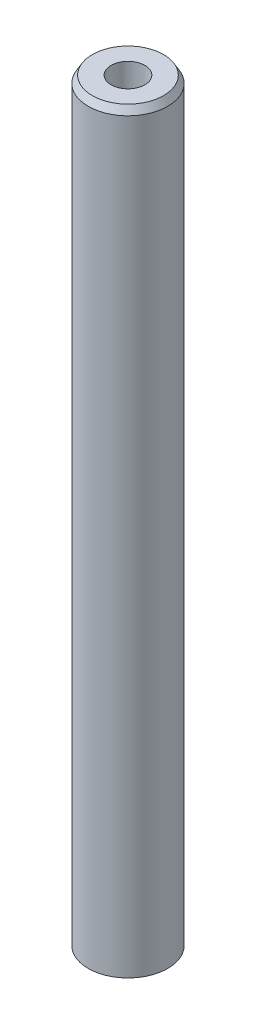
ISO-10303-21;
HEADER;
FILE_DESCRIPTION(('STEP AP214'),'2;1');
FILE_NAME('part.step','',(''),(''),'','','');
FILE_SCHEMA(('AUTOMOTIVE_DESIGN { 1 0 10303 214 1 1 1 1 }'));
ENDSEC;
DATA;
#1=APPLICATION_CONTEXT('core data for automotive mechanical design processes');
#2=APPLICATION_PROTOCOL_DEFINITION('international standard','automotive_design',2000,#1);
#3=PRODUCT_CONTEXT('',#1,'mechanical');
#4=PRODUCT('Part','Part','',(#3));
#5=PRODUCT_RELATED_PRODUCT_CATEGORY('part','',(#4));
#6=PRODUCT_DEFINITION_FORMATION('','',#4);
#7=PRODUCT_DEFINITION_CONTEXT('part definition',#1,'design');
#8=PRODUCT_DEFINITION('design','',#6,#7);
#9=PRODUCT_DEFINITION_SHAPE('','',#8);
#10=(LENGTH_UNIT() NAMED_UNIT(*) SI_UNIT(.MILLI.,.METRE.));
#11=(NAMED_UNIT(*) PLANE_ANGLE_UNIT() SI_UNIT($,.RADIAN.));
#12=(NAMED_UNIT(*) SI_UNIT($,.STERADIAN.) SOLID_ANGLE_UNIT());
#13=UNCERTAINTY_MEASURE_WITH_UNIT(LENGTH_MEASURE(1.E-05),#10,'distance_accuracy_value','');
#14=(GEOMETRIC_REPRESENTATION_CONTEXT(3) GLOBAL_UNCERTAINTY_ASSIGNED_CONTEXT((#13)) GLOBAL_UNIT_ASSIGNED_CONTEXT((#10,
#11,#12)) REPRESENTATION_CONTEXT('',''));
#15=CARTESIAN_POINT('',(0.,0.,0.));
#16=DIRECTION('',(0.,0.,1.));
#17=DIRECTION('',(1.,0.,0.));
#18=AXIS2_PLACEMENT_3D('',#15,#16,#17);
#19=CARTESIAN_POINT('',(0.,571.957207302122,0.));
#20=DIRECTION('',(0.,-1.,0.));
#21=DIRECTION('',(0.,0.,-1.));
#22=AXIS2_PLACEMENT_3D('',#19,#20,#21);
#23=CYLINDRICAL_SURFACE('',#22,30.);
#24=CARTESIAN_POINT('',(0.,566.540098582314,0.));
#25=DIRECTION('',(0.,1.,0.));
#26=DIRECTION('',(0.,0.,1.));
#27=AXIS2_PLACEMENT_3D('',#24,#25,#26);
#28=CIRCLE('',#27,30.);
#29=CARTESIAN_POINT('',(0.,566.540098582314,30.));
#30=VERTEX_POINT('',#29);
#31=EDGE_CURVE('E50',#30,#30,#28,.F.);
#32=ORIENTED_EDGE('',*,*,#31,.T.);
#33=EDGE_LOOP('',(#32));
#34=FACE_BOUND('',#33,.T.);
#35=CARTESIAN_POINT('',(0.,3.12756917761048,0.));
#36=DIRECTION('',(0.,1.,0.));
#37=DIRECTION('',(0.,0.,1.));
#38=AXIS2_PLACEMENT_3D('',#35,#36,#37);
#39=CIRCLE('',#38,30.);
#40=CARTESIAN_POINT('',(0.,3.12756917761048,30.));
#41=VERTEX_POINT('',#40);
#42=EDGE_CURVE('E51',#41,#41,#39,.T.);
#43=ORIENTED_EDGE('',*,*,#42,.T.);
#44=EDGE_LOOP('',(#43));
#45=FACE_BOUND('',#44,.T.);
#46=ADVANCED_FACE('F39',(#34,#45),#23,.T.);
#47=CARTESIAN_POINT('',(0.,571.957207302122,0.));
#48=DIRECTION('',(0.,1.,0.));
#49=DIRECTION('',(0.,0.,1.));
#50=AXIS2_PLACEMENT_3D('',#47,#48,#49);
#51=PLANE('',#50);
#52=CARTESIAN_POINT('',(0.,571.957207302122,0.));
#53=DIRECTION('',(0.,1.,0.));
#54=DIRECTION('',(0.,0.,1.));
#55=AXIS2_PLACEMENT_3D('',#52,#53,#54);
#56=CIRCLE('',#55,26.8724308223893);
#57=CARTESIAN_POINT('',(0.,571.957207302122,26.8724308223893));
#58=VERTEX_POINT('',#57);
#59=EDGE_CURVE('E54',#58,#58,#56,.T.);
#60=ORIENTED_EDGE('',*,*,#59,.T.);
#61=EDGE_LOOP('',(#60));
#62=FACE_BOUND('',#61,.T.);
#63=CARTESIAN_POINT('',(0.,571.957207302122,0.));
#64=DIRECTION('',(0.,1.,0.));
#65=DIRECTION('',(0.,0.,1.));
#66=AXIS2_PLACEMENT_3D('',#63,#64,#65);
#67=CIRCLE('',#66,12.7332960718022);
#68=CARTESIAN_POINT('',(0.,571.957207302122,12.7332960718022));
#69=VERTEX_POINT('',#68);
#70=EDGE_CURVE('E58',#69,#69,#67,.T.);
#71=ORIENTED_EDGE('',*,*,#70,.F.);
#72=EDGE_LOOP('',(#71));
#73=FACE_BOUND('',#72,.T.);
#74=ADVANCED_FACE('F69',(#62,#73),#51,.T.);
#75=CARTESIAN_POINT('',(0.,0.,0.));
#76=DIRECTION('',(0.,1.,0.));
#77=DIRECTION('',(0.,0.,1.));
#78=AXIS2_PLACEMENT_3D('',#75,#76,#77);
#79=PLANE('',#78);
#80=CARTESIAN_POINT('',(0.,0.,0.));
#81=DIRECTION('',(0.,1.,0.));
#82=DIRECTION('',(0.,0.,1.));
#83=AXIS2_PLACEMENT_3D('',#80,#81,#82);
#84=CIRCLE('',#83,24.5828912801921);
#85=CARTESIAN_POINT('',(0.,0.,24.5828912801921));
#86=VERTEX_POINT('',#85);
#87=EDGE_CURVE('E10',#86,#86,#84,.F.);
#88=ORIENTED_EDGE('',*,*,#87,.T.);
#89=EDGE_LOOP('',(#88));
#90=FACE_BOUND('',#89,.T.);
#91=CARTESIAN_POINT('',(0.,0.,0.));
#92=DIRECTION('',(0.,1.,0.));
#93=DIRECTION('',(0.,0.,1.));
#94=AXIS2_PLACEMENT_3D('',#91,#92,#93);
#95=CIRCLE('',#94,12.7332960718022);
#96=CARTESIAN_POINT('',(0.,0.,12.7332960718022));
#97=VERTEX_POINT('',#96);
#98=EDGE_CURVE('E63',#97,#97,#95,.T.);
#99=ORIENTED_EDGE('',*,*,#98,.T.);
#100=EDGE_LOOP('',(#99));
#101=FACE_BOUND('',#100,.T.);
#102=ADVANCED_FACE('F75',(#90,#101),#79,.F.);
#103=CARTESIAN_POINT('',(0.,571.957207302122,0.));
#104=DIRECTION('',(0.,-1.,0.));
#105=DIRECTION('',(0.,0.,-1.));
#106=AXIS2_PLACEMENT_3D('',#103,#104,#105);
#107=CYLINDRICAL_SURFACE('',#106,12.7332960718022);
#108=ORIENTED_EDGE('',*,*,#70,.T.);
#109=EDGE_LOOP('',(#108));
#110=FACE_BOUND('',#109,.T.);
#111=ORIENTED_EDGE('',*,*,#98,.F.);
#112=EDGE_LOOP('',(#111));
#113=FACE_BOUND('',#112,.T.);
#114=ADVANCED_FACE('F70',(#110,#113),#107,.F.);
#115=CARTESIAN_POINT('',(0.,571.957207302122,0.));
#116=DIRECTION('',(0.,-1.,0.));
#117=DIRECTION('',(0.,0.,-1.));
#118=AXIS2_PLACEMENT_3D('',#115,#116,#117);
#119=CONICAL_SURFACE('',#118,26.8724308223893,0.523598775598302);
#120=ORIENTED_EDGE('',*,*,#31,.F.);
#121=EDGE_LOOP('',(#120));
#122=FACE_BOUND('',#121,.T.);
#123=ORIENTED_EDGE('',*,*,#59,.F.);
#124=EDGE_LOOP('',(#123));
#125=FACE_BOUND('',#124,.T.);
#126=ADVANCED_FACE('F81',(#122,#125),#119,.T.);
#127=CARTESIAN_POINT('',(0.,3.12756917761048,0.));
#128=DIRECTION('',(0.,1.,0.));
#129=DIRECTION('',(0.,0.,1.));
#130=AXIS2_PLACEMENT_3D('',#127,#128,#129);
#131=CONICAL_SURFACE('',#130,30.,1.04719755119661);
#132=ORIENTED_EDGE('',*,*,#87,.F.);
#133=EDGE_LOOP('',(#132));
#134=FACE_BOUND('',#133,.T.);
#135=ORIENTED_EDGE('',*,*,#42,.F.);
#136=EDGE_LOOP('',(#135));
#137=FACE_BOUND('',#136,.T.);
#138=ADVANCED_FACE('F45',(#134,#137),#131,.T.);
#139=CLOSED_SHELL('',(#46,#74,#102,#114,#126,#138));
#140=MANIFOLD_SOLID_BREP('B2',#139);
#141=ADVANCED_BREP_SHAPE_REPRESENTATION('',(#18,#140),#14);
#142=SHAPE_DEFINITION_REPRESENTATION(#9,#141);
ENDSEC;
END-ISO-10303-21;
